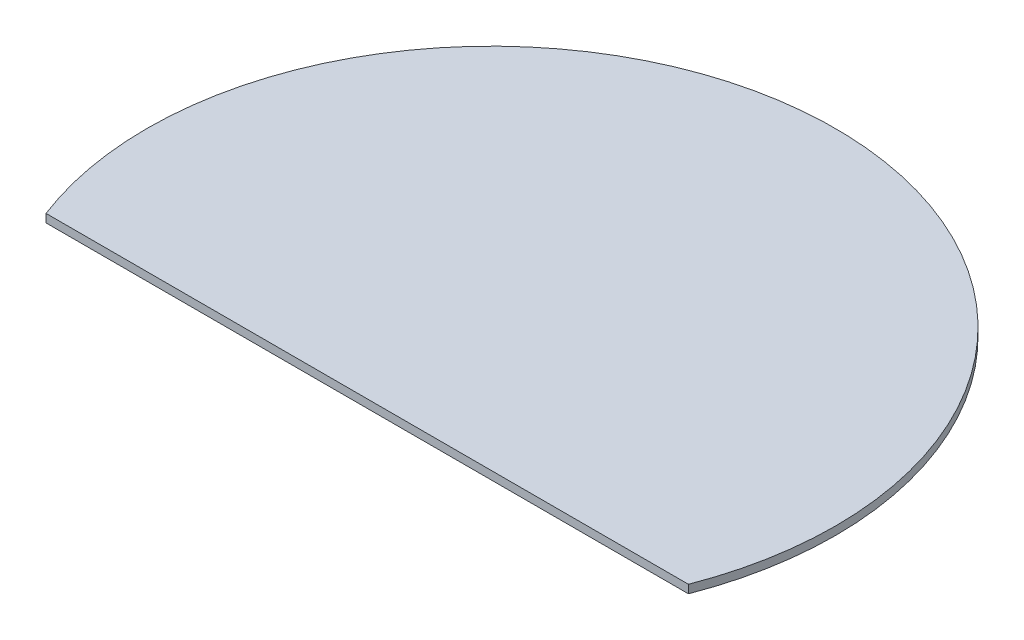
ISO-10303-21;
HEADER;
FILE_DESCRIPTION(('STEP AP214'),'2;1');
FILE_NAME('part.step','',(''),(''),'','','');
FILE_SCHEMA(('AUTOMOTIVE_DESIGN { 1 0 10303 214 1 1 1 1 }'));
ENDSEC;
DATA;
#1=APPLICATION_CONTEXT('core data for automotive mechanical design processes');
#2=APPLICATION_PROTOCOL_DEFINITION('international standard','automotive_design',2000,#1);
#3=PRODUCT_CONTEXT('',#1,'mechanical');
#4=PRODUCT('Part','Part','',(#3));
#5=PRODUCT_RELATED_PRODUCT_CATEGORY('part','',(#4));
#6=PRODUCT_DEFINITION_FORMATION('','',#4);
#7=PRODUCT_DEFINITION_CONTEXT('part definition',#1,'design');
#8=PRODUCT_DEFINITION('design','',#6,#7);
#9=PRODUCT_DEFINITION_SHAPE('','',#8);
#10=(LENGTH_UNIT() NAMED_UNIT(*) SI_UNIT(.MILLI.,.METRE.));
#11=(NAMED_UNIT(*) PLANE_ANGLE_UNIT() SI_UNIT($,.RADIAN.));
#12=(NAMED_UNIT(*) SI_UNIT($,.STERADIAN.) SOLID_ANGLE_UNIT());
#13=UNCERTAINTY_MEASURE_WITH_UNIT(LENGTH_MEASURE(1.E-05),#10,'distance_accuracy_value','');
#14=(GEOMETRIC_REPRESENTATION_CONTEXT(3) GLOBAL_UNCERTAINTY_ASSIGNED_CONTEXT((#13)) GLOBAL_UNIT_ASSIGNED_CONTEXT((#10,
#11,#12)) REPRESENTATION_CONTEXT('',''));
#15=CARTESIAN_POINT('',(0.,0.,0.));
#16=DIRECTION('',(0.,0.,1.));
#17=DIRECTION('',(1.,0.,0.));
#18=AXIS2_PLACEMENT_3D('',#15,#16,#17);
#19=CARTESIAN_POINT('',(-17.8076536899108,3.,0.854894606578442));
#20=DIRECTION('',(0.,-1.,0.));
#21=DIRECTION('',(0.,0.,-1.));
#22=AXIS2_PLACEMENT_3D('',#19,#20,#21);
#23=CYLINDRICAL_SURFACE('',#22,125.);
#24=CARTESIAN_POINT('',(-17.8076536899108,3.,0.854894606578442));
#25=DIRECTION('',(0.,1.,0.));
#26=DIRECTION('',(0.,0.,1.));
#27=AXIS2_PLACEMENT_3D('',#24,#25,#26);
#28=CIRCLE('',#27,125.);
#29=CARTESIAN_POINT('',(98.8113842069952,3.,45.8548946065784));
#30=VERTEX_POINT('',#29);
#31=CARTESIAN_POINT('',(-134.426691586817,3.,45.8548946065784));
#32=VERTEX_POINT('',#31);
#33=EDGE_CURVE('E11',#30,#32,#28,.T.);
#34=ORIENTED_EDGE('',*,*,#33,.F.);
#35=DIRECTION('',(0.,-1.,0.));
#36=VECTOR('',#35,1.);
#37=CARTESIAN_POINT('',(98.8113842069952,3.,45.8548946065784));
#38=LINE('',#37,#36);
#39=CARTESIAN_POINT('',(98.8113842069952,0.,45.8548946065784));
#40=VERTEX_POINT('',#39);
#41=EDGE_CURVE('E53',#30,#40,#38,.T.);
#42=ORIENTED_EDGE('',*,*,#41,.T.);
#43=CARTESIAN_POINT('',(-17.8076536899108,0.,0.854894606578442));
#44=DIRECTION('',(0.,1.,0.));
#45=DIRECTION('',(0.,0.,1.));
#46=AXIS2_PLACEMENT_3D('',#43,#44,#45);
#47=CIRCLE('',#46,125.);
#48=CARTESIAN_POINT('',(-134.426691586817,0.,45.8548946065784));
#49=VERTEX_POINT('',#48);
#50=EDGE_CURVE('E36',#40,#49,#47,.T.);
#51=ORIENTED_EDGE('',*,*,#50,.T.);
#52=DIRECTION('',(0.,-1.,0.));
#53=VECTOR('',#52,1.);
#54=CARTESIAN_POINT('',(-134.426691586817,3.,45.8548946065784));
#55=LINE('',#54,#53);
#56=EDGE_CURVE('E47',#32,#49,#55,.T.);
#57=ORIENTED_EDGE('',*,*,#56,.F.);
#58=EDGE_LOOP('',(#34,#42,#51,#57));
#59=FACE_BOUND('',#58,.T.);
#60=ADVANCED_FACE('F33',(#59),#23,.T.);
#61=CARTESIAN_POINT('',(-17.8076536899108,3.,0.854894606578442));
#62=DIRECTION('',(0.,1.,0.));
#63=DIRECTION('',(0.,0.,1.));
#64=AXIS2_PLACEMENT_3D('',#61,#62,#63);
#65=PLANE('',#64);
#66=DIRECTION('',(1.,0.,0.));
#67=VECTOR('',#66,1.);
#68=CARTESIAN_POINT('',(0.,3.,45.8548946065784));
#69=LINE('',#68,#67);
#70=EDGE_CURVE('E62',#32,#30,#69,.T.);
#71=ORIENTED_EDGE('',*,*,#70,.T.);
#72=ORIENTED_EDGE('',*,*,#33,.T.);
#73=EDGE_LOOP('',(#71,#72));
#74=FACE_BOUND('',#73,.T.);
#75=ADVANCED_FACE('F69',(#74),#65,.T.);
#76=CARTESIAN_POINT('',(-17.8076536899108,0.,0.854894606578442));
#77=DIRECTION('',(0.,1.,0.));
#78=DIRECTION('',(0.,0.,1.));
#79=AXIS2_PLACEMENT_3D('',#76,#77,#78);
#80=PLANE('',#79);
#81=ORIENTED_EDGE('',*,*,#50,.F.);
#82=DIRECTION('',(1.,0.,0.));
#83=VECTOR('',#82,1.);
#84=CARTESIAN_POINT('',(0.,0.,45.8548946065784));
#85=LINE('',#84,#83);
#86=EDGE_CURVE('E57',#49,#40,#85,.T.);
#87=ORIENTED_EDGE('',*,*,#86,.F.);
#88=EDGE_LOOP('',(#81,#87));
#89=FACE_BOUND('',#88,.T.);
#90=ADVANCED_FACE('F67',(#89),#80,.F.);
#91=CARTESIAN_POINT('',(0.,3.,45.8548946065784));
#92=DIRECTION('',(0.,0.,-1.));
#93=DIRECTION('',(-1.,0.,0.));
#94=AXIS2_PLACEMENT_3D('',#91,#92,#93);
#95=PLANE('',#94);
#96=ORIENTED_EDGE('',*,*,#86,.T.);
#97=ORIENTED_EDGE('',*,*,#41,.F.);
#98=ORIENTED_EDGE('',*,*,#70,.F.);
#99=ORIENTED_EDGE('',*,*,#56,.T.);
#100=EDGE_LOOP('',(#96,#97,#98,#99));
#101=FACE_BOUND('',#100,.T.);
#102=ADVANCED_FACE('F58',(#101),#95,.F.);
#103=CLOSED_SHELL('',(#60,#75,#90,#102));
#104=MANIFOLD_SOLID_BREP('B2',#103);
#105=ADVANCED_BREP_SHAPE_REPRESENTATION('',(#18,#104),#14);
#106=SHAPE_DEFINITION_REPRESENTATION(#9,#105);
ENDSEC;
END-ISO-10303-21;
